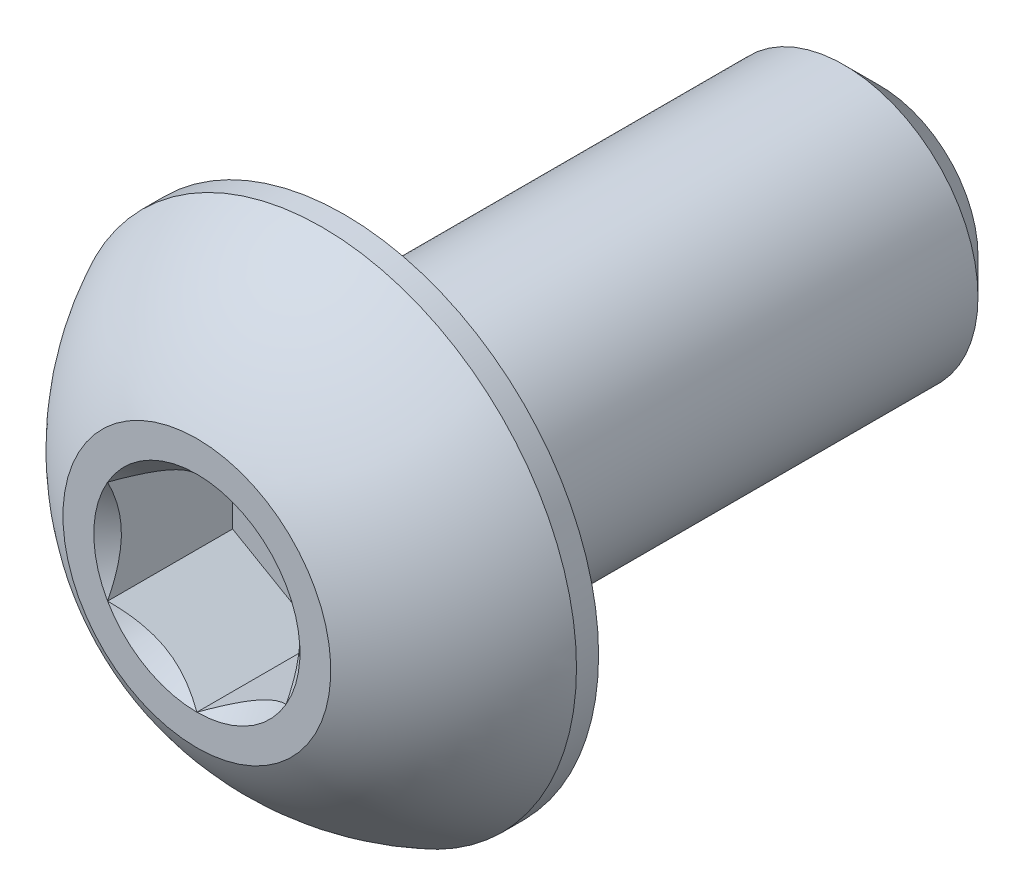
ISO-10303-21;
HEADER;
FILE_DESCRIPTION(('STEP AP214'),'2;1');
FILE_NAME('part.step','',(''),(''),'','','');
FILE_SCHEMA(('AUTOMOTIVE_DESIGN { 1 0 10303 214 1 1 1 1 }'));
ENDSEC;
DATA;
#1=APPLICATION_CONTEXT('core data for automotive mechanical design processes');
#2=APPLICATION_PROTOCOL_DEFINITION('international standard','automotive_design',2000,#1);
#3=PRODUCT_CONTEXT('',#1,'mechanical');
#4=PRODUCT('Part','Part','',(#3));
#5=PRODUCT_RELATED_PRODUCT_CATEGORY('part','',(#4));
#6=PRODUCT_DEFINITION_FORMATION('','',#4);
#7=PRODUCT_DEFINITION_CONTEXT('part definition',#1,'design');
#8=PRODUCT_DEFINITION('design','',#6,#7);
#9=PRODUCT_DEFINITION_SHAPE('','',#8);
#10=(LENGTH_UNIT() NAMED_UNIT(*) SI_UNIT(.MILLI.,.METRE.));
#11=(NAMED_UNIT(*) PLANE_ANGLE_UNIT() SI_UNIT($,.RADIAN.));
#12=(NAMED_UNIT(*) SI_UNIT($,.STERADIAN.) SOLID_ANGLE_UNIT());
#13=UNCERTAINTY_MEASURE_WITH_UNIT(LENGTH_MEASURE(1.E-05),#10,'distance_accuracy_value','');
#14=(GEOMETRIC_REPRESENTATION_CONTEXT(3) GLOBAL_UNCERTAINTY_ASSIGNED_CONTEXT((#13)) GLOBAL_UNIT_ASSIGNED_CONTEXT((#10,
#11,#12)) REPRESENTATION_CONTEXT('',''));
#15=CARTESIAN_POINT('',(0.,0.,0.));
#16=DIRECTION('',(0.,0.,1.));
#17=DIRECTION('',(1.,0.,0.));
#18=AXIS2_PLACEMENT_3D('',#15,#16,#17);
#19=CARTESIAN_POINT('',(0.,0.,3.825));
#20=DIRECTION('',(0.,0.,-1.));
#21=DIRECTION('',(-1.,0.,0.));
#22=AXIS2_PLACEMENT_3D('',#19,#20,#21);
#23=PLANE('',#22);
#24=CARTESIAN_POINT('',(0.,0.,3.825));
#25=DIRECTION('',(0.,0.,1.));
#26=DIRECTION('',(1.,0.,0.));
#27=AXIS2_PLACEMENT_3D('',#24,#25,#26);
#28=CIRCLE('',#27,1.15470053837925);
#29=CARTESIAN_POINT('',(-1.,0.577350269189626,3.825));
#30=VERTEX_POINT('',#29);
#31=CARTESIAN_POINT('',(-1.,-0.577350269189626,3.825));
#32=VERTEX_POINT('',#31);
#33=EDGE_CURVE('E134',#30,#32,#28,.T.);
#34=ORIENTED_EDGE('',*,*,#33,.F.);
#35=CARTESIAN_POINT('',(0.,1.15470053837925,3.825));
#36=VERTEX_POINT('',#35);
#37=EDGE_CURVE('E106',#36,#30,#28,.T.);
#38=ORIENTED_EDGE('',*,*,#37,.F.);
#39=CARTESIAN_POINT('',(1.,0.577350269189626,3.825));
#40=VERTEX_POINT('',#39);
#41=EDGE_CURVE('E97',#40,#36,#28,.T.);
#42=ORIENTED_EDGE('',*,*,#41,.F.);
#43=CARTESIAN_POINT('',(1.,-0.577350269189626,3.825));
#44=VERTEX_POINT('',#43);
#45=EDGE_CURVE('E58',#44,#40,#28,.T.);
#46=ORIENTED_EDGE('',*,*,#45,.F.);
#47=CARTESIAN_POINT('',(0.,-1.15470053837925,3.825));
#48=VERTEX_POINT('',#47);
#49=EDGE_CURVE('E65',#48,#44,#28,.T.);
#50=ORIENTED_EDGE('',*,*,#49,.F.);
#51=EDGE_CURVE('E135',#32,#48,#28,.T.);
#52=ORIENTED_EDGE('',*,*,#51,.F.);
#53=EDGE_LOOP('',(#34,#38,#42,#46,#50,#52));
#54=FACE_BOUND('',#53,.T.);
#55=CARTESIAN_POINT('',(0.,0.,3.825));
#56=DIRECTION('',(0.,0.,1.));
#57=DIRECTION('',(1.,0.,0.));
#58=AXIS2_PLACEMENT_3D('',#55,#56,#57);
#59=CIRCLE('',#58,1.5);
#60=CARTESIAN_POINT('',(0.,1.5,3.825));
#61=VERTEX_POINT('',#60);
#62=EDGE_CURVE('E52',#61,#61,#59,.T.);
#63=ORIENTED_EDGE('',*,*,#62,.T.);
#64=EDGE_LOOP('',(#63));
#65=FACE_BOUND('',#64,.T.);
#66=ADVANCED_FACE('F39',(#54,#65),#23,.F.);
#67=CARTESIAN_POINT('',(0.,0.,1.03016711229946));
#68=DIRECTION('',(0.,0.,1.));
#69=DIRECTION('',(0.,1.,0.));
#70=AXIS2_PLACEMENT_3D('',#67,#68,#69);
#71=SPHERICAL_SURFACE('',#70,3.17192226735973);
#72=CARTESIAN_POINT('',(0.,0.,2.4225));
#73=DIRECTION('',(0.,0.,1.));
#74=DIRECTION('',(1.,0.,0.));
#75=AXIS2_PLACEMENT_3D('',#72,#73,#74);
#76=CIRCLE('',#75,2.85);
#77=CARTESIAN_POINT('',(0.,2.85,2.4225));
#78=VERTEX_POINT('',#77);
#79=EDGE_CURVE('E217',#78,#78,#76,.T.);
#80=CARTESIAN_POINT('',(0.,1.5,3.825));
#81=CARTESIAN_POINT('',(0.,1.5181600798921,3.81525343052663));
#82=CARTESIAN_POINT('',(0.,1.53622513742981,3.80532981527615));
#83=CARTESIAN_POINT('',(0.,1.57215840256594,3.78513236887069));
#84=CARTESIAN_POINT('',(0.,1.59002661016438,3.7748585377157));
#85=CARTESIAN_POINT('',(0.,1.6255593701915,3.75396453515097));
#86=CARTESIAN_POINT('',(0.,1.64322392262019,3.74334436374123));
#87=CARTESIAN_POINT('',(0.,1.67834266450262,3.72176172357303));
#88=CARTESIAN_POINT('',(0.,1.69579685395635,3.71079925481458));
#89=CARTESIAN_POINT('',(0.,1.73048823664554,3.68853618336439));
#90=CARTESIAN_POINT('',(0.,1.74772542988099,3.67723558067265));
#91=CARTESIAN_POINT('',(0.,1.78197627078176,3.65430053581285));
#92=CARTESIAN_POINT('',(0.,1.79898991844709,3.64266609364478));
#93=CARTESIAN_POINT('',(0.,1.83278720341135,3.61906779045309));
#94=CARTESIAN_POINT('',(0.,1.84957084071028,3.60710392942946));
#95=CARTESIAN_POINT('',(0.,1.88290172764636,3.58285133450125));
#96=CARTESIAN_POINT('',(0.,1.8994489772835,3.57056260059666));
#97=CARTESIAN_POINT('',(0.,1.93230080139369,3.54566492927458));
#98=CARTESIAN_POINT('',(0.,1.94860537586673,3.53305599185708));
#99=CARTESIAN_POINT('',(0.,1.98096565436365,3.50752270455889));
#100=CARTESIAN_POINT('',(0.,1.99702135838753,3.49459835467819));
#101=CARTESIAN_POINT('',(0.,2.02887779526296,3.46843915334777));
#102=CARTESIAN_POINT('',(0.,2.04467852811452,3.45520430189805));
#103=CARTESIAN_POINT('',(0.,2.07601901880464,3.42842912630669));
#104=CARTESIAN_POINT('',(0.,2.09155877664321,3.41488880216506));
#105=CARTESIAN_POINT('',(0.,2.12237141262985,3.38750782613789));
#106=CARTESIAN_POINT('',(0.,2.13764429077792,3.37366717425237));
#107=CARTESIAN_POINT('',(0.,2.16791736411296,3.34569080180173));
#108=CARTESIAN_POINT('',(0.,2.18291755929993,3.33155508123662));
#109=CARTESIAN_POINT('',(0.,2.21263956705415,3.30299394260905));
#110=CARTESIAN_POINT('',(0.,2.22736137962139,3.28856852454658));
#111=CARTESIAN_POINT('',(0.,2.2565210282552,3.25943347218353));
#112=CARTESIAN_POINT('',(0.,2.27095886432177,3.24472383788295));
#113=CARTESIAN_POINT('',(0.,2.2995450739765,3.2150259422972));
#114=CARTESIAN_POINT('',(0.,2.31369344756465,3.20003768101205));
#115=CARTESIAN_POINT('',(0.,2.34169535627252,3.16978822658124));
#116=CARTESIAN_POINT('',(0.,2.35554889139223,3.15452703343559));
#117=CARTESIAN_POINT('',(0.,2.38295585920366,3.12373751411442));
#118=CARTESIAN_POINT('',(0.,2.39650929189537,3.1082091879389));
#119=CARTESIAN_POINT('',(0.,2.42331090492182,3.07689130289176));
#120=CARTESIAN_POINT('',(0.,2.43655908525656,3.06110174402014));
#121=CARTESIAN_POINT('',(0.,2.46274515962755,3.02926739317577));
#122=CARTESIAN_POINT('',(0.,2.47568305366379,3.01322260120302));
#123=CARTESIAN_POINT('',(0.,2.5012436393965,2.98088388073287));
#124=CARTESIAN_POINT('',(0.,2.51386633109298,2.96458995223548));
#125=CARTESIAN_POINT('',(0.,2.53879171587278,2.9317591499574));
#126=CARTESIAN_POINT('',(0.,2.55109440895612,2.91522227617671));
#127=CARTESIAN_POINT('',(0.,2.57537512182785,2.88191186688636));
#128=CARTESIAN_POINT('',(0.,2.58735314161625,2.8651383313767));
#129=CARTESIAN_POINT('',(0.,2.61097995657956,2.83136097210575));
#130=CARTESIAN_POINT('',(0.,2.62262875175448,2.81435714834448));
#131=CARTESIAN_POINT('',(0.,2.64559269128199,2.78012567355775));
#132=CARTESIAN_POINT('',(0.,2.65690783563458,2.76289802253229));
#133=CARTESIAN_POINT('',(0.,2.67920017403639,2.72822543922701));
#134=CARTESIAN_POINT('',(0.,2.69017736808561,2.71078050694718));
#135=CARTESIAN_POINT('',(0.,2.711789634999,2.67567998980005));
#136=CARTESIAN_POINT('',(0.,2.72242470786316,2.65802440493275));
#137=CARTESIAN_POINT('',(0.,2.74334869082118,2.62250929096057));
#138=CARTESIAN_POINT('',(0.,2.75363760091502,2.60464976185571));
#139=CARTESIAN_POINT('',(0.,2.77386535089241,2.56873354659176));
#140=CARTESIAN_POINT('',(0.,2.78380419077596,2.55067686043268));
#141=CARTESIAN_POINT('',(0.,2.80332801615778,2.51437318815589));
#142=CARTESIAN_POINT('',(0.,2.81291300165605,2.49612620203818));
#143=CARTESIAN_POINT('',(0.,2.83172550494215,2.4594488779161));
#144=CARTESIAN_POINT('',(0.,2.84095302272998,2.44101853991173));
#145=CARTESIAN_POINT('',(0.,2.85,2.4225));
#146=B_SPLINE_CURVE_WITH_KNOTS('',3,(#80,#81,#82,#83,#84,#85,#86,#87,#88,#89,#90,#91,#92,#93,
#94,#95,#96,#97,#98,#99,#100,#101,#102,#103,#104,#105,#106,#107,#108,#109,#110,#111,#112,#113,
#114,#115,#116,#117,#118,#119,#120,#121,#122,#123,#124,#125,#126,#127,#128,#129,#130,#131,#132,
#133,#134,#135,#136,#137,#138,#139,#140,#141,#142,#143,#144,#145),.UNSPECIFIED.,.F.,.F.,(4,2,2,
2,2,2,2,2,2,2,2,2,2,2,2,2,2,2,2,2,2,2,2,2,2,2,2,2,2,2,2,2,4),(0.,0.0618298941826979,
0.123659788365397,0.185489682548094,0.247319576730793,0.309149470913491,0.370979365096189,
0.432809259278887,0.494639153461586,0.556469047644284,0.618298941826982,0.68012883600968,
0.741958730192379,0.803788624375077,0.865618518557775,0.927448412740473,0.989278306923171,
1.05110820110587,1.11293809528857,1.17476798947127,1.23659788365396,1.29842777783666,
1.36025767201936,1.42208756620206,1.48391746038476,1.54574735456746,1.60757724875015,
1.66940714293285,1.73123703711555,1.79306693129825,1.85489682548095,1.91672671966364,
1.97855661384634),.UNSPECIFIED.);
#147=EDGE_CURVE('BSEAM222',#61,#78,#146,.T.);
#148=ORIENTED_EDGE('',*,*,#62,.F.);
#149=ORIENTED_EDGE('',*,*,#79,.T.);
#150=ORIENTED_EDGE('',*,*,#147,.T.);
#151=ORIENTED_EDGE('',*,*,#147,.F.);
#152=EDGE_LOOP('',(#148,#150,#149,#151));
#153=FACE_BOUND('',#152,.T.);
#154=ADVANCED_FACE('F222',(#153),#71,.T.);
#155=CARTESIAN_POINT('',(0.,0.,3.825));
#156=DIRECTION('',(0.,0.,1.));
#157=DIRECTION('',(1.,0.,0.));
#158=AXIS2_PLACEMENT_3D('',#155,#156,#157);
#159=CYLINDRICAL_SURFACE('',#158,2.85);
#160=ORIENTED_EDGE('',*,*,#79,.F.);
#161=EDGE_LOOP('',(#160));
#162=FACE_BOUND('',#161,.T.);
#163=CARTESIAN_POINT('',(0.,0.,2.175));
#164=DIRECTION('',(0.,0.,1.));
#165=DIRECTION('',(1.,0.,0.));
#166=AXIS2_PLACEMENT_3D('',#163,#164,#165);
#167=CIRCLE('',#166,2.85);
#168=CARTESIAN_POINT('',(2.85,0.,2.175));
#169=VERTEX_POINT('',#168);
#170=EDGE_CURVE('E214',#169,#169,#167,.T.);
#171=ORIENTED_EDGE('',*,*,#170,.T.);
#172=EDGE_LOOP('',(#171));
#173=FACE_BOUND('',#172,.T.);
#174=ADVANCED_FACE('F225',(#162,#173),#159,.T.);
#175=CARTESIAN_POINT('',(0.,1.5,2.175));
#176=DIRECTION('',(0.,0.,1.));
#177=DIRECTION('',(1.,0.,0.));
#178=AXIS2_PLACEMENT_3D('',#175,#176,#177);
#179=PLANE('',#178);
#180=ORIENTED_EDGE('',*,*,#170,.F.);
#181=EDGE_LOOP('',(#180));
#182=FACE_BOUND('',#181,.T.);
#183=CARTESIAN_POINT('',(0.,0.,2.175));
#184=DIRECTION('',(0.,0.,1.));
#185=DIRECTION('',(1.,0.,0.));
#186=AXIS2_PLACEMENT_3D('',#183,#184,#185);
#187=CIRCLE('',#186,1.5);
#188=CARTESIAN_POINT('',(1.5,0.,2.175));
#189=VERTEX_POINT('',#188);
#190=EDGE_CURVE('E211',#189,#189,#187,.T.);
#191=ORIENTED_EDGE('',*,*,#190,.T.);
#192=EDGE_LOOP('',(#191));
#193=FACE_BOUND('',#192,.T.);
#194=ADVANCED_FACE('F230',(#182,#193),#179,.F.);
#195=CARTESIAN_POINT('',(0.,0.,3.825));
#196=DIRECTION('',(0.,0.,1.));
#197=DIRECTION('',(1.,0.,0.));
#198=AXIS2_PLACEMENT_3D('',#195,#196,#197);
#199=CYLINDRICAL_SURFACE('',#198,1.5);
#200=ORIENTED_EDGE('',*,*,#190,.F.);
#201=EDGE_LOOP('',(#200));
#202=FACE_BOUND('',#201,.T.);
#203=CARTESIAN_POINT('',(0.,0.,-3.425));
#204=DIRECTION('',(0.,0.,1.));
#205=DIRECTION('',(1.,0.,0.));
#206=AXIS2_PLACEMENT_3D('',#203,#204,#205);
#207=CIRCLE('',#206,1.5);
#208=CARTESIAN_POINT('',(1.5,0.,-3.425));
#209=VERTEX_POINT('',#208);
#210=EDGE_CURVE('E208',#209,#209,#207,.T.);
#211=ORIENTED_EDGE('',*,*,#210,.T.);
#212=EDGE_LOOP('',(#211));
#213=FACE_BOUND('',#212,.T.);
#214=ADVANCED_FACE('F236',(#202,#213),#199,.T.);
#215=CARTESIAN_POINT('',(0.,0.,-3.825));
#216=DIRECTION('',(0.,0.,1.));
#217=DIRECTION('',(1.,0.,0.));
#218=AXIS2_PLACEMENT_3D('',#215,#216,#217);
#219=CONICAL_SURFACE('',#218,1.1,0.785398163397444);
#220=ORIENTED_EDGE('',*,*,#210,.F.);
#221=EDGE_LOOP('',(#220));
#222=FACE_BOUND('',#221,.T.);
#223=CARTESIAN_POINT('',(0.,0.,-3.825));
#224=DIRECTION('',(0.,0.,1.));
#225=DIRECTION('',(1.,0.,0.));
#226=AXIS2_PLACEMENT_3D('',#223,#224,#225);
#227=CIRCLE('',#226,1.1);
#228=CARTESIAN_POINT('',(1.1,0.,-3.825));
#229=VERTEX_POINT('',#228);
#230=EDGE_CURVE('E195',#229,#229,#227,.T.);
#231=ORIENTED_EDGE('',*,*,#230,.T.);
#232=EDGE_LOOP('',(#231));
#233=FACE_BOUND('',#232,.T.);
#234=ADVANCED_FACE('F242',(#222,#233),#219,.T.);
#235=CARTESIAN_POINT('',(0.,0.,-3.825));
#236=DIRECTION('',(0.,0.,1.));
#237=DIRECTION('',(1.,0.,0.));
#238=AXIS2_PLACEMENT_3D('',#235,#236,#237);
#239=PLANE('',#238);
#240=ORIENTED_EDGE('',*,*,#230,.F.);
#241=EDGE_LOOP('',(#240));
#242=FACE_BOUND('',#241,.T.);
#243=ADVANCED_FACE('F168',(#242),#239,.F.);
#244=CARTESIAN_POINT('',(0.,0.,3.825));
#245=DIRECTION('',(0.,0.,1.));
#246=DIRECTION('',(1.,0.,0.));
#247=AXIS2_PLACEMENT_3D('',#244,#245,#246);
#248=CONICAL_SURFACE('',#247,1.15470053837925,0.78539816339745);
#249=ORIENTED_EDGE('',*,*,#37,.T.);
#250=CARTESIAN_POINT('',(0.000200000000000047,1.15481600843309,3.82511548737261));
#251=CARTESIAN_POINT('',(-0.0341825950071806,1.13496520795026,3.80527793082573));
#252=CARTESIAN_POINT('',(-0.0691401181398248,1.11478247255942,3.78660502063889));
#253=CARTESIAN_POINT('',(-0.14042280295609,1.07362739529219,3.75241474272316));
#254=CARTESIAN_POINT('',(-0.176754750528984,1.0526511355808,3.73691640902346));
#255=CARTESIAN_POINT('',(-0.250016613803311,1.01035337909803,3.71036730714226));
#256=CARTESIAN_POINT('',(-0.286927851445414,0.989042666109241,3.69924977399692));
#257=CARTESIAN_POINT('',(-0.361562729310859,0.945952199282692,3.68211986577618));
#258=CARTESIAN_POINT('',(-0.399284088108636,0.924173762626597,3.67609469746667));
#259=CARTESIAN_POINT('',(-0.464292198417934,0.886641312640015,3.67066055496749));
#260=CARTESIAN_POINT('',(-0.491494371528172,0.870936130672276,3.66985693831673));
#261=CARTESIAN_POINT('',(-0.545846040669112,0.839556179862849,3.67120669941689));
#262=CARTESIAN_POINT('',(-0.572995523754876,0.823881418494924,3.6733607295472));
#263=CARTESIAN_POINT('',(-0.65405627732696,0.777080970599367,3.68411697212847));
#264=CARTESIAN_POINT('',(-0.707564140978427,0.746188191116431,3.69701455641535));
#265=CARTESIAN_POINT('',(-0.801476065143432,0.69196811641965,3.72814073060218));
#266=CARTESIAN_POINT('',(-0.842320523671834,0.668386557293372,3.74473779770184));
#267=CARTESIAN_POINT('',(-0.922409637381944,0.622147085933682,3.78212492468529));
#268=CARTESIAN_POINT('',(-0.961659010870438,0.599486449584576,3.8029013418174));
#269=CARTESIAN_POINT('',(-1.0002,0.577234799135789,3.82511548737261));
#270=B_SPLINE_CURVE_WITH_KNOTS('',3,(#250,#251,#252,#253,#254,#255,#256,#257,#258,#259,#260,
#261,#262,#263,#264,#265,#266,#267,#268,#269),.UNSPECIFIED.,.F.,.F.,(4,2,2,2,2,2,2,2,2,4),(0.,
0.133237676828559,0.26725222983449,0.3991370762693,0.530689603280768,0.624814864263846,
0.718960890149133,0.907306626112098,1.05710100361789,1.20641411519286),.UNSPECIFIED.);
#271=EDGE_CURVE('E11',#36,#30,#270,.T.);
#272=ORIENTED_EDGE('',*,*,#271,.F.);
#273=EDGE_LOOP('',(#249,#272));
#274=FACE_BOUND('',#273,.T.);
#275=ADVANCED_FACE('F110',(#274),#248,.F.);
#276=ORIENTED_EDGE('',*,*,#33,.T.);
#277=CARTESIAN_POINT('',(-1.,-1.15147208646462,4.19538567751386));
#278=CARTESIAN_POINT('',(-1.,-1.12343447988552,4.17421991987371));
#279=CARTESIAN_POINT('',(-1.,-1.09524064850697,4.15326169217591));
#280=CARTESIAN_POINT('',(-1.,-1.03847715644376,4.11184602223562));
#281=CARTESIAN_POINT('',(-1.,-1.00990740382975,4.09138870612366));
#282=CARTESIAN_POINT('',(-1.,-0.923120894333476,4.03060479495451));
#283=CARTESIAN_POINT('',(-1.,-0.864253173759059,3.9911922289614));
#284=CARTESIAN_POINT('',(-1.,-0.740809858258045,3.9138206642002));
#285=CARTESIAN_POINT('',(-1.,-0.676100255137807,3.87607303911434));
#286=CARTESIAN_POINT('',(-1.,-0.543448939049124,3.80702458755129));
#287=CARTESIAN_POINT('',(-1.,-0.475519112027779,3.77570202784686));
#288=CARTESIAN_POINT('',(-1.,-0.373555850333528,3.73738177888379));
#289=CARTESIAN_POINT('',(-1.,-0.341031989670907,3.72638359164215));
#290=CARTESIAN_POINT('',(-1.,-0.275199079052293,3.70699834214736));
#291=CARTESIAN_POINT('',(-1.,-0.241889975173933,3.6986114597767));
#292=CARTESIAN_POINT('',(-1.,-0.175247517042992,3.68502522071901));
#293=CARTESIAN_POINT('',(-1.,-0.141925568218175,3.67977079076797));
#294=CARTESIAN_POINT('',(-1.,-0.0749144362322788,3.67254868657089));
#295=CARTESIAN_POINT('',(-1.,-0.0412251978501616,3.67058151361051));
#296=CARTESIAN_POINT('',(-1.,0.0249580992634211,3.67008319839316));
#297=CARTESIAN_POINT('',(-1.,0.0574512826460393,3.67143026788863));
#298=CARTESIAN_POINT('',(-1.,0.122148505701867,3.67721648449898));
#299=CARTESIAN_POINT('',(-1.,0.154352610132926,3.68165492066153));
#300=CARTESIAN_POINT('',(-1.,0.21879989886764,3.6934568301452));
#301=CARTESIAN_POINT('',(-1.,0.251033743268953,3.70087054103851));
#302=CARTESIAN_POINT('',(-1.,0.314797132354919,3.71822894249867));
#303=CARTESIAN_POINT('',(-1.,0.346326735731004,3.72817342128883));
#304=CARTESIAN_POINT('',(-1.,0.445594187730205,3.76322348255433));
#305=CARTESIAN_POINT('',(-1.,0.511919139476036,3.79232085835672));
#306=CARTESIAN_POINT('',(-1.,0.641453244657532,3.8570153296865));
#307=CARTESIAN_POINT('',(-1.,0.704650133126344,3.89263577671524));
#308=CARTESIAN_POINT('',(-1.,0.825428490174986,3.96612390134693));
#309=CARTESIAN_POINT('',(-1.,0.883132947867684,4.00379194713546));
#310=CARTESIAN_POINT('',(-1.,0.968148853704564,4.06202285294316));
#311=CARTESIAN_POINT('',(-1.,0.996120570380284,4.08163847576285));
#312=CARTESIAN_POINT('',(-1.,1.05168177729901,4.12138851706127));
#313=CARTESIAN_POINT('',(-1.,1.079271369977,4.14152279219883));
#314=CARTESIAN_POINT('',(-1.,1.10670185346329,4.16187211907297));
#315=B_SPLINE_CURVE_WITH_KNOTS('',3,(#277,#278,#279,#280,#281,#282,#283,#284,#285,#286,#287,
#288,#289,#290,#291,#292,#293,#294,#295,#296,#297,#298,#299,#300,#301,#302,#303,#304,#305,#306,
#307,#308,#309,#310,#311,#312,#313,#314),.UNSPECIFIED.,.F.,.F.,(4,2,2,2,2,2,2,2,2,2,2,2,2,2,2,2,
2,2,4),(0.,0.105386459083291,0.210799187330124,0.423233611565468,0.647793540908503,
0.871580877738609,0.974493074181421,1.07741235827201,1.17846428203205,1.27953161415762,
1.3769408673961,1.47432772585408,1.57343322804293,1.67253043972851,1.88917353996827,
2.10660791038813,2.31323734249843,2.41572589232044,2.51818641476503),.UNSPECIFIED.);
#316=EDGE_CURVE('E105',#30,#32,#315,.F.);
#317=ORIENTED_EDGE('',*,*,#316,.F.);
#318=EDGE_LOOP('',(#276,#317));
#319=FACE_BOUND('',#318,.T.);
#320=ADVANCED_FACE('F255',(#319),#248,.F.);
#321=ORIENTED_EDGE('',*,*,#51,.T.);
#322=CARTESIAN_POINT('',(-1.0002,-0.577234799135788,3.82511548737261));
#323=CARTESIAN_POINT('',(-0.965817404992819,-0.597085599618621,3.80527793082573));
#324=CARTESIAN_POINT('',(-0.930859881860175,-0.617268335009456,3.78660502063889));
#325=CARTESIAN_POINT('',(-0.85957719704391,-0.658423412276686,3.75241474272316));
#326=CARTESIAN_POINT('',(-0.823245249471016,-0.67939967198808,3.73691640902346));
#327=CARTESIAN_POINT('',(-0.749983386196689,-0.721697428470846,3.71036730714226));
#328=CARTESIAN_POINT('',(-0.713072148554586,-0.743008141459636,3.69924977399692));
#329=CARTESIAN_POINT('',(-0.638437270689141,-0.786098608286186,3.68211986577618));
#330=CARTESIAN_POINT('',(-0.600715911891364,-0.807877044942281,3.67609469746667));
#331=CARTESIAN_POINT('',(-0.535707801582067,-0.845409494928862,3.67066055496749));
#332=CARTESIAN_POINT('',(-0.508505628471828,-0.861114676896601,3.66985693831673));
#333=CARTESIAN_POINT('',(-0.454153959330888,-0.892494627706028,3.67120669941689));
#334=CARTESIAN_POINT('',(-0.427004476245125,-0.908169389073953,3.6733607295472));
#335=CARTESIAN_POINT('',(-0.34594372267304,-0.95496983696951,3.68411697212847));
#336=CARTESIAN_POINT('',(-0.292435859021573,-0.985862616452447,3.69701455641535));
#337=CARTESIAN_POINT('',(-0.198523934856569,-1.04008269114923,3.72814073060218));
#338=CARTESIAN_POINT('',(-0.157679476328166,-1.06366425027551,3.74473779770184));
#339=CARTESIAN_POINT('',(-0.0775903626180565,-1.1099037216352,3.78212492468529));
#340=CARTESIAN_POINT('',(-0.0383409891295625,-1.1325643579843,3.8029013418174));
#341=CARTESIAN_POINT('',(0.000199999999999785,-1.15481600843309,3.82511548737261));
#342=B_SPLINE_CURVE_WITH_KNOTS('',3,(#322,#323,#324,#325,#326,#327,#328,#329,#330,#331,#332,
#333,#334,#335,#336,#337,#338,#339,#340,#341),.UNSPECIFIED.,.F.,.F.,(4,2,2,2,2,2,2,2,2,4),(0.,
0.133237676828559,0.26725222983449,0.3991370762693,0.530689603280768,0.624814864263846,
0.718960890149133,0.907306626112097,1.05710100361789,1.20641411519286),.UNSPECIFIED.);
#343=EDGE_CURVE('E144',#32,#48,#342,.T.);
#344=ORIENTED_EDGE('',*,*,#343,.F.);
#345=EDGE_LOOP('',(#321,#344));
#346=FACE_BOUND('',#345,.T.);
#347=ADVANCED_FACE('F272',(#346),#248,.F.);
#348=ORIENTED_EDGE('',*,*,#49,.T.);
#349=CARTESIAN_POINT('',(-0.000200000000000145,-1.15481600843309,3.82511548737261));
#350=CARTESIAN_POINT('',(0.0341825950071805,-1.13496520795026,3.80527793082573));
#351=CARTESIAN_POINT('',(0.0691401181398246,-1.11478247255942,3.78660502063889));
#352=CARTESIAN_POINT('',(0.140422802956089,-1.07362739529219,3.75241474272316));
#353=CARTESIAN_POINT('',(0.176754750528984,-1.0526511355808,3.73691640902346));
#354=CARTESIAN_POINT('',(0.250016613803311,-1.01035337909803,3.71036730714226));
#355=CARTESIAN_POINT('',(0.286927851445414,-0.98904266610924,3.69924977399692));
#356=CARTESIAN_POINT('',(0.361562729310859,-0.945952199282691,3.68211986577618));
#357=CARTESIAN_POINT('',(0.399284088108636,-0.924173762626596,3.67609469746667));
#358=CARTESIAN_POINT('',(0.464292198417933,-0.886641312640014,3.67066055496749));
#359=CARTESIAN_POINT('',(0.491494371528172,-0.870936130672275,3.66985693831673));
#360=CARTESIAN_POINT('',(0.545846040669112,-0.839556179862848,3.67120669941689));
#361=CARTESIAN_POINT('',(0.572995523754876,-0.823881418494923,3.6733607295472));
#362=CARTESIAN_POINT('',(0.65405627732696,-0.777080970599366,3.68411697212847));
#363=CARTESIAN_POINT('',(0.707564140978427,-0.74618819111643,3.69701455641535));
#364=CARTESIAN_POINT('',(0.801476065143431,-0.691968116419649,3.72814073060218));
#365=CARTESIAN_POINT('',(0.842320523671834,-0.668386557293371,3.74473779770184));
#366=CARTESIAN_POINT('',(0.922409637381944,-0.622147085933681,3.78212492468529));
#367=CARTESIAN_POINT('',(0.961659010870438,-0.599486449584575,3.8029013418174));
#368=CARTESIAN_POINT('',(1.0002,-0.577234799135788,3.82511548737261));
#369=B_SPLINE_CURVE_WITH_KNOTS('',3,(#349,#350,#351,#352,#353,#354,#355,#356,#357,#358,#359,
#360,#361,#362,#363,#364,#365,#366,#367,#368),.UNSPECIFIED.,.F.,.F.,(4,2,2,2,2,2,2,2,2,4),(0.,
0.133237676828559,0.26725222983449,0.3991370762693,0.530689603280768,0.624814864263846,
0.718960890149133,0.907306626112097,1.05710100361789,1.20641411519286),.UNSPECIFIED.);
#370=EDGE_CURVE('E352',#48,#44,#369,.T.);
#371=ORIENTED_EDGE('',*,*,#370,.F.);
#372=EDGE_LOOP('',(#348,#371));
#373=FACE_BOUND('',#372,.T.);
#374=ADVANCED_FACE('F279',(#373),#248,.F.);
#375=ORIENTED_EDGE('',*,*,#45,.T.);
#376=CARTESIAN_POINT('',(1.,-1.15147208663215,4.19538567764035));
#377=CARTESIAN_POINT('',(1.,-1.12343448004835,4.17421991999533));
#378=CARTESIAN_POINT('',(1.,-1.09524064866509,4.15326169229266));
#379=CARTESIAN_POINT('',(1.,-1.0384771565924,4.11184602234267));
#380=CARTESIAN_POINT('',(1.,-1.00990740397363,4.09138870622588));
#381=CARTESIAN_POINT('',(1.,-0.923120894462775,4.03060479504212));
#382=CARTESIAN_POINT('',(1.,-0.864253173878445,3.99119222903932));
#383=CARTESIAN_POINT('',(1.,-0.740809858355811,3.91382066425819));
#384=CARTESIAN_POINT('',(1.,-0.676100255223808,3.87607303916216));
#385=CARTESIAN_POINT('',(1.,-0.543448939110597,3.80702458758025));
#386=CARTESIAN_POINT('',(1.,-0.475519112076495,3.77570202786713));
#387=CARTESIAN_POINT('',(1.,-0.373555850372648,3.7373817788976));
#388=CARTESIAN_POINT('',(1.,-0.341031989714046,3.72638359165621));
#389=CARTESIAN_POINT('',(1.,-0.275199079103601,3.70699834216111));
#390=CARTESIAN_POINT('',(1.,-0.241889975229392,3.69861145978989));
#391=CARTESIAN_POINT('',(1.,-0.175247517106615,3.68502522073014));
#392=CARTESIAN_POINT('',(1.,-0.141925568285808,3.67977079077761));
#393=CARTESIAN_POINT('',(1.,-0.0749144363078009,3.67254868657667));
#394=CARTESIAN_POINT('',(1.,-0.0412251979295626,3.6705815136139));
#395=CARTESIAN_POINT('',(1.,0.0249580991768645,3.67008319839111));
#396=CARTESIAN_POINT('',(1.,0.057451282556196,3.67143026788357));
#397=CARTESIAN_POINT('',(1.,0.122148505605779,3.67721648448742));
#398=CARTESIAN_POINT('',(1.,0.154352610033881,3.68165492064648));
#399=CARTESIAN_POINT('',(1.,0.218799898762755,3.69345683012285));
#400=CARTESIAN_POINT('',(1.,0.251033743161196,3.70087054101231));
#401=CARTESIAN_POINT('',(1.,0.314797132241694,3.71822894246471));
#402=CARTESIAN_POINT('',(1.,0.346326735615184,3.72817342125094));
#403=CARTESIAN_POINT('',(1.,0.445594187589164,3.76322348249794));
#404=CARTESIAN_POINT('',(1.,0.511919139313635,3.7923208582833));
#405=CARTESIAN_POINT('',(1.,0.641453244454049,3.85701532957714));
#406=CARTESIAN_POINT('',(1.,0.704650132903151,3.89263577658696));
#407=CARTESIAN_POINT('',(1.,0.825428489916356,3.96612390118245));
#408=CARTESIAN_POINT('',(1.,0.883132947593201,4.00379194695385));
#409=CARTESIAN_POINT('',(1.,0.968148853406642,4.06202285273595));
#410=CARTESIAN_POINT('',(1.,0.99612057007466,4.08163847554718));
#411=CARTESIAN_POINT('',(1.,1.05168177697804,4.12138851682867));
#412=CARTESIAN_POINT('',(1.,1.07927136964838,4.14152279195778));
#413=CARTESIAN_POINT('',(1.,1.10670185312703,4.16187211882347));
#414=B_SPLINE_CURVE_WITH_KNOTS('',3,(#376,#377,#378,#379,#380,#381,#382,#383,#384,#385,#386,
#387,#388,#389,#390,#391,#392,#393,#394,#395,#396,#397,#398,#399,#400,#401,#402,#403,#404,#405,
#406,#407,#408,#409,#410,#411,#412,#413),.UNSPECIFIED.,.F.,.F.,(4,2,2,2,2,2,2,2,2,2,2,2,2,2,2,2,
2,2,4),(0.,0.10538645910335,0.210799187370248,0.423233611646473,0.64779354103535,
0.871580877910865,0.974493074342054,1.07741235842104,1.17846428216995,1.27953161428439,
1.37694086751269,1.47432772596047,1.57343322813835,1.67253043981296,1.88917353997386,
2.10660791031433,2.31323734235672,2.41572589214523,2.51818641455632),.UNSPECIFIED.);
#415=EDGE_CURVE('E122',#44,#40,#414,.T.);
#416=ORIENTED_EDGE('',*,*,#415,.F.);
#417=EDGE_LOOP('',(#375,#416));
#418=FACE_BOUND('',#417,.T.);
#419=ADVANCED_FACE('F286',(#418),#248,.F.);
#420=ORIENTED_EDGE('',*,*,#41,.T.);
#421=CARTESIAN_POINT('',(1.0002,0.577234799135789,3.82511548737261));
#422=CARTESIAN_POINT('',(0.965817404992819,0.597085599618622,3.80527793082573));
#423=CARTESIAN_POINT('',(0.930859881860175,0.617268335009457,3.78660502063889));
#424=CARTESIAN_POINT('',(0.859577197043911,0.658423412276686,3.75241474272316));
#425=CARTESIAN_POINT('',(0.823245249471016,0.67939967198808,3.73691640902346));
#426=CARTESIAN_POINT('',(0.749983386196689,0.721697428470847,3.71036730714226));
#427=CARTESIAN_POINT('',(0.713072148554586,0.743008141459637,3.69924977399693));
#428=CARTESIAN_POINT('',(0.638437270689141,0.786098608286186,3.68211986577618));
#429=CARTESIAN_POINT('',(0.600715911891365,0.807877044942281,3.67609469746667));
#430=CARTESIAN_POINT('',(0.535707801582067,0.845409494928863,3.67066055496749));
#431=CARTESIAN_POINT('',(0.508505628471829,0.861114676896602,3.66985693831673));
#432=CARTESIAN_POINT('',(0.454153959330889,0.892494627706029,3.67120669941689));
#433=CARTESIAN_POINT('',(0.427004476245125,0.908169389073954,3.6733607295472));
#434=CARTESIAN_POINT('',(0.34594372267304,0.954969836969511,3.68411697212847));
#435=CARTESIAN_POINT('',(0.292435859021573,0.985862616452447,3.69701455641535));
#436=CARTESIAN_POINT('',(0.198523934856569,1.04008269114923,3.72814073060218));
#437=CARTESIAN_POINT('',(0.157679476328166,1.06366425027551,3.74473779770184));
#438=CARTESIAN_POINT('',(0.0775903626180566,1.1099037216352,3.78212492468529));
#439=CARTESIAN_POINT('',(0.0383409891295624,1.1325643579843,3.8029013418174));
#440=CARTESIAN_POINT('',(-0.000199999999999812,1.15481600843309,3.82511548737261));
#441=B_SPLINE_CURVE_WITH_KNOTS('',3,(#421,#422,#423,#424,#425,#426,#427,#428,#429,#430,#431,
#432,#433,#434,#435,#436,#437,#438,#439,#440),.UNSPECIFIED.,.F.,.F.,(4,2,2,2,2,2,2,2,2,4),(0.,
0.133237676828559,0.267252229834489,0.399137076269299,0.530689603280767,0.624814864263845,
0.718960890149132,0.907306626112096,1.05710100361789,1.20641411519286),.UNSPECIFIED.);
#442=EDGE_CURVE('E101',#40,#36,#441,.T.);
#443=ORIENTED_EDGE('',*,*,#442,.F.);
#444=EDGE_LOOP('',(#420,#443));
#445=FACE_BOUND('',#444,.T.);
#446=ADVANCED_FACE('F99',(#445),#248,.F.);
#447=CARTESIAN_POINT('',(0.,0.,2.425));
#448=DIRECTION('',(0.,0.,1.));
#449=DIRECTION('',(1.,0.,0.));
#450=AXIS2_PLACEMENT_3D('',#447,#448,#449);
#451=PLANE('',#450);
#452=DIRECTION('',(-0.866025403784439,0.5,0.));
#453=VECTOR('',#452,1.);
#454=CARTESIAN_POINT('',(1.,0.577350269189626,2.425));
#455=LINE('',#454,#453);
#456=CARTESIAN_POINT('',(1.,0.577350269189626,2.425));
#457=VERTEX_POINT('',#456);
#458=CARTESIAN_POINT('',(0.,1.15470053837925,2.425));
#459=VERTEX_POINT('',#458);
#460=EDGE_CURVE('E121',#457,#459,#455,.T.);
#461=ORIENTED_EDGE('',*,*,#460,.T.);
#462=DIRECTION('',(-0.866025403784439,-0.5,0.));
#463=VECTOR('',#462,1.);
#464=CARTESIAN_POINT('',(0.,1.15470053837925,2.425));
#465=LINE('',#464,#463);
#466=CARTESIAN_POINT('',(-1.,0.577350269189626,2.425));
#467=VERTEX_POINT('',#466);
#468=EDGE_CURVE('E126',#459,#467,#465,.T.);
#469=ORIENTED_EDGE('',*,*,#468,.T.);
#470=DIRECTION('',(0.,-1.,0.));
#471=VECTOR('',#470,1.);
#472=CARTESIAN_POINT('',(-1.,0.577350269189626,2.425));
#473=LINE('',#472,#471);
#474=CARTESIAN_POINT('',(-1.,-0.577350269189625,2.425));
#475=VERTEX_POINT('',#474);
#476=EDGE_CURVE('E183',#467,#475,#473,.T.);
#477=ORIENTED_EDGE('',*,*,#476,.T.);
#478=DIRECTION('',(0.866025403784438,-0.5,0.));
#479=VECTOR('',#478,1.);
#480=CARTESIAN_POINT('',(-1.,-0.577350269189625,2.425));
#481=LINE('',#480,#479);
#482=CARTESIAN_POINT('',(0.,-1.15470053837925,2.425));
#483=VERTEX_POINT('',#482);
#484=EDGE_CURVE('E186',#475,#483,#481,.T.);
#485=ORIENTED_EDGE('',*,*,#484,.T.);
#486=DIRECTION('',(0.866025403784439,0.5,0.));
#487=VECTOR('',#486,1.);
#488=CARTESIAN_POINT('',(0.,-1.15470053837925,2.425));
#489=LINE('',#488,#487);
#490=CARTESIAN_POINT('',(1.,-0.577350269189626,2.425));
#491=VERTEX_POINT('',#490);
#492=EDGE_CURVE('E189',#483,#491,#489,.T.);
#493=ORIENTED_EDGE('',*,*,#492,.T.);
#494=DIRECTION('',(0.,1.,0.));
#495=VECTOR('',#494,1.);
#496=CARTESIAN_POINT('',(1.,-0.577350269189626,2.425));
#497=LINE('',#496,#495);
#498=EDGE_CURVE('E129',#491,#457,#497,.T.);
#499=ORIENTED_EDGE('',*,*,#498,.T.);
#500=EDGE_LOOP('',(#461,#469,#477,#485,#493,#499));
#501=FACE_BOUND('',#500,.T.);
#502=ADVANCED_FACE('F163',(#501),#451,.T.);
#503=CARTESIAN_POINT('',(0.,1.15470053837925,2.425));
#504=DIRECTION('',(-0.5,0.866025403784439,0.));
#505=DIRECTION('',(-0.866025403784439,-0.5,0.));
#506=AXIS2_PLACEMENT_3D('',#503,#504,#505);
#507=PLANE('',#506);
#508=DIRECTION('',(0.,0.,1.));
#509=VECTOR('',#508,1.);
#510=CARTESIAN_POINT('',(0.,1.15470053837925,2.425));
#511=LINE('',#510,#509);
#512=EDGE_CURVE('E118',#459,#36,#511,.T.);
#513=ORIENTED_EDGE('',*,*,#512,.T.);
#514=ORIENTED_EDGE('',*,*,#271,.T.);
#515=DIRECTION('',(0.,0.,1.));
#516=VECTOR('',#515,1.);
#517=CARTESIAN_POINT('',(-1.,0.577350269189626,2.425));
#518=LINE('',#517,#516);
#519=EDGE_CURVE('E128',#467,#30,#518,.T.);
#520=ORIENTED_EDGE('',*,*,#519,.F.);
#521=ORIENTED_EDGE('',*,*,#468,.F.);
#522=EDGE_LOOP('',(#513,#514,#520,#521));
#523=FACE_BOUND('',#522,.T.);
#524=ADVANCED_FACE('F124',(#523),#507,.F.);
#525=CARTESIAN_POINT('',(-1.,0.577350269189626,2.425));
#526=DIRECTION('',(-1.,0.,0.));
#527=DIRECTION('',(0.,0.,1.));
#528=AXIS2_PLACEMENT_3D('',#525,#526,#527);
#529=PLANE('',#528);
#530=ORIENTED_EDGE('',*,*,#519,.T.);
#531=ORIENTED_EDGE('',*,*,#316,.T.);
#532=DIRECTION('',(0.,0.,1.));
#533=VECTOR('',#532,1.);
#534=CARTESIAN_POINT('',(-1.,-0.577350269189625,2.425));
#535=LINE('',#534,#533);
#536=EDGE_CURVE('E202',#475,#32,#535,.T.);
#537=ORIENTED_EDGE('',*,*,#536,.F.);
#538=ORIENTED_EDGE('',*,*,#476,.F.);
#539=EDGE_LOOP('',(#530,#531,#537,#538));
#540=FACE_BOUND('',#539,.T.);
#541=ADVANCED_FACE('F153',(#540),#529,.F.);
#542=CARTESIAN_POINT('',(-1.,-0.577350269189625,2.425));
#543=DIRECTION('',(-0.5,-0.866025403784438,0.));
#544=DIRECTION('',(0.866025403784439,-0.5,0.));
#545=AXIS2_PLACEMENT_3D('',#542,#543,#544);
#546=PLANE('',#545);
#547=ORIENTED_EDGE('',*,*,#536,.T.);
#548=ORIENTED_EDGE('',*,*,#343,.T.);
#549=DIRECTION('',(0.,0.,1.));
#550=VECTOR('',#549,1.);
#551=CARTESIAN_POINT('',(0.,-1.15470053837925,2.425));
#552=LINE('',#551,#550);
#553=EDGE_CURVE('E199',#483,#48,#552,.T.);
#554=ORIENTED_EDGE('',*,*,#553,.F.);
#555=ORIENTED_EDGE('',*,*,#484,.F.);
#556=EDGE_LOOP('',(#547,#548,#554,#555));
#557=FACE_BOUND('',#556,.T.);
#558=ADVANCED_FACE('F156',(#557),#546,.F.);
#559=CARTESIAN_POINT('',(0.,-1.15470053837925,2.425));
#560=DIRECTION('',(0.5,-0.866025403784439,0.));
#561=DIRECTION('',(0.866025403784439,0.5,0.));
#562=AXIS2_PLACEMENT_3D('',#559,#560,#561);
#563=PLANE('',#562);
#564=ORIENTED_EDGE('',*,*,#553,.T.);
#565=ORIENTED_EDGE('',*,*,#370,.T.);
#566=DIRECTION('',(0.,0.,1.));
#567=VECTOR('',#566,1.);
#568=CARTESIAN_POINT('',(1.,-0.577350269189626,2.425));
#569=LINE('',#568,#567);
#570=EDGE_CURVE('E196',#491,#44,#569,.T.);
#571=ORIENTED_EDGE('',*,*,#570,.F.);
#572=ORIENTED_EDGE('',*,*,#492,.F.);
#573=EDGE_LOOP('',(#564,#565,#571,#572));
#574=FACE_BOUND('',#573,.T.);
#575=ADVANCED_FACE('F310',(#574),#563,.F.);
#576=CARTESIAN_POINT('',(1.,-0.577350269189626,2.425));
#577=DIRECTION('',(1.,0.,0.));
#578=DIRECTION('',(0.,1.,0.));
#579=AXIS2_PLACEMENT_3D('',#576,#577,#578);
#580=PLANE('',#579);
#581=ORIENTED_EDGE('',*,*,#570,.T.);
#582=ORIENTED_EDGE('',*,*,#415,.T.);
#583=DIRECTION('',(0.,0.,1.));
#584=VECTOR('',#583,1.);
#585=CARTESIAN_POINT('',(1.,0.577350269189626,2.425));
#586=LINE('',#585,#584);
#587=EDGE_CURVE('E120',#457,#40,#586,.T.);
#588=ORIENTED_EDGE('',*,*,#587,.F.);
#589=ORIENTED_EDGE('',*,*,#498,.F.);
#590=EDGE_LOOP('',(#581,#582,#588,#589));
#591=FACE_BOUND('',#590,.T.);
#592=ADVANCED_FACE('F167',(#591),#580,.F.);
#593=CARTESIAN_POINT('',(1.,0.577350269189626,2.425));
#594=DIRECTION('',(0.5,0.866025403784439,0.));
#595=DIRECTION('',(-0.866025403784439,0.5,0.));
#596=AXIS2_PLACEMENT_3D('',#593,#594,#595);
#597=PLANE('',#596);
#598=ORIENTED_EDGE('',*,*,#587,.T.);
#599=ORIENTED_EDGE('',*,*,#442,.T.);
#600=ORIENTED_EDGE('',*,*,#512,.F.);
#601=ORIENTED_EDGE('',*,*,#460,.F.);
#602=EDGE_LOOP('',(#598,#599,#600,#601));
#603=FACE_BOUND('',#602,.T.);
#604=ADVANCED_FACE('F116',(#603),#597,.F.);
#605=CLOSED_SHELL('',(#66,#154,#174,#194,#214,#234,#243,#275,#320,#347,#374,#419,#446,#502,#524,
#541,#558,#575,#592,#604));
#606=MANIFOLD_SOLID_BREP('B2',#605);
#607=ADVANCED_BREP_SHAPE_REPRESENTATION('',(#18,#606),#14);
#608=SHAPE_DEFINITION_REPRESENTATION(#9,#607);
ENDSEC;
END-ISO-10303-21;
